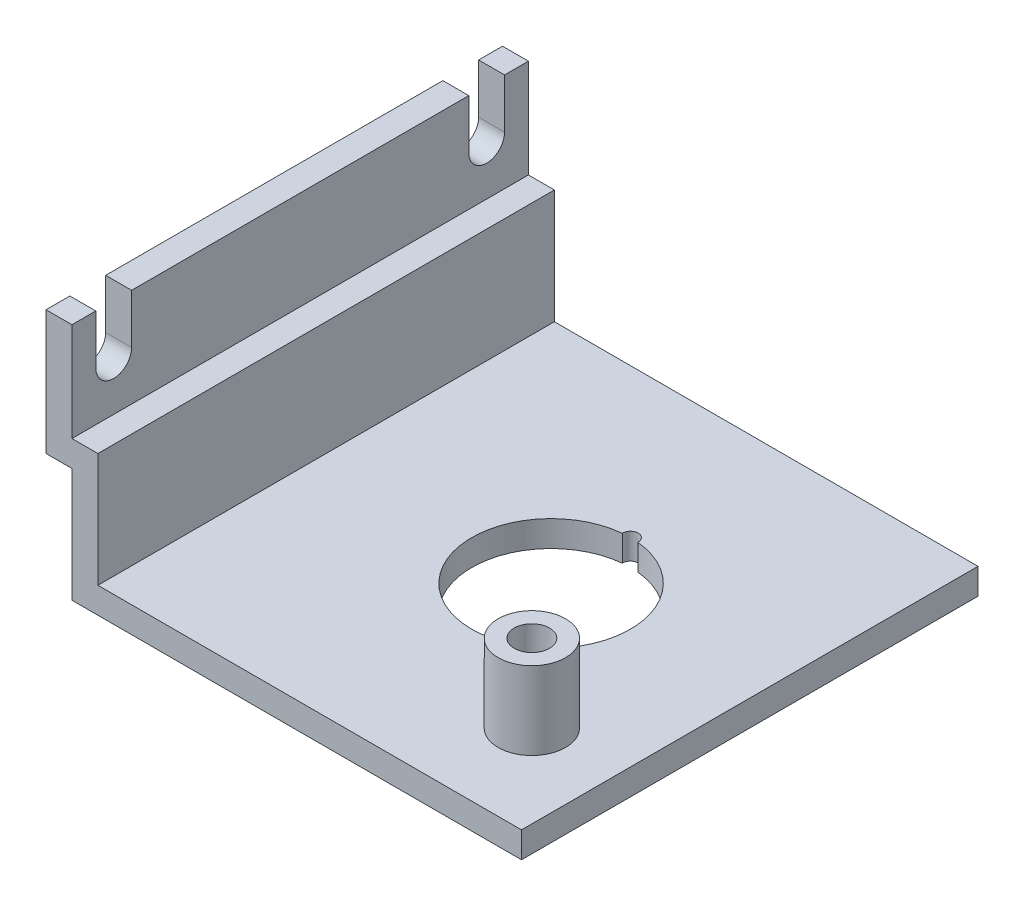
ISO-10303-21;
HEADER;
FILE_DESCRIPTION(('STEP AP214'),'2;1');
FILE_NAME('part.step','',(''),(''),'','','');
FILE_SCHEMA(('AUTOMOTIVE_DESIGN { 1 0 10303 214 1 1 1 1 }'));
ENDSEC;
DATA;
#1=APPLICATION_CONTEXT('core data for automotive mechanical design processes');
#2=APPLICATION_PROTOCOL_DEFINITION('international standard','automotive_design',2000,#1);
#3=PRODUCT_CONTEXT('',#1,'mechanical');
#4=PRODUCT('Part','Part','',(#3));
#5=PRODUCT_RELATED_PRODUCT_CATEGORY('part','',(#4));
#6=PRODUCT_DEFINITION_FORMATION('','',#4);
#7=PRODUCT_DEFINITION_CONTEXT('part definition',#1,'design');
#8=PRODUCT_DEFINITION('design','',#6,#7);
#9=PRODUCT_DEFINITION_SHAPE('','',#8);
#10=(LENGTH_UNIT() NAMED_UNIT(*) SI_UNIT(.MILLI.,.METRE.));
#11=(NAMED_UNIT(*) PLANE_ANGLE_UNIT() SI_UNIT($,.RADIAN.));
#12=(NAMED_UNIT(*) SI_UNIT($,.STERADIAN.) SOLID_ANGLE_UNIT());
#13=UNCERTAINTY_MEASURE_WITH_UNIT(LENGTH_MEASURE(1.E-05),#10,'distance_accuracy_value','');
#14=(GEOMETRIC_REPRESENTATION_CONTEXT(3) GLOBAL_UNCERTAINTY_ASSIGNED_CONTEXT((#13)) GLOBAL_UNIT_ASSIGNED_CONTEXT((#10,
#11,#12)) REPRESENTATION_CONTEXT('',''));
#15=CARTESIAN_POINT('',(0.,0.,0.));
#16=DIRECTION('',(0.,0.,1.));
#17=DIRECTION('',(1.,0.,0.));
#18=AXIS2_PLACEMENT_3D('',#15,#16,#17);
#19=CARTESIAN_POINT('',(-4.99999999999999,46.,88.));
#20=DIRECTION('',(0.,-1.,0.));
#21=DIRECTION('',(0.,0.,-1.));
#22=AXIS2_PLACEMENT_3D('',#19,#20,#21);
#23=PLANE('',#22);
#24=DIRECTION('',(0.,0.,-1.));
#25=VECTOR('',#24,1.);
#26=CARTESIAN_POINT('',(0.,46.,88.));
#27=LINE('',#26,#25);
#28=CARTESIAN_POINT('',(0.,46.,76.5));
#29=VERTEX_POINT('',#28);
#30=CARTESIAN_POINT('',(0.,46.,11.5));
#31=VERTEX_POINT('',#30);
#32=EDGE_CURVE('E319',#29,#31,#27,.T.);
#33=ORIENTED_EDGE('',*,*,#32,.T.);
#34=DIRECTION('',(-1.,0.,0.));
#35=VECTOR('',#34,1.);
#36=CARTESIAN_POINT('',(86.661,46.,11.5));
#37=LINE('',#36,#35);
#38=CARTESIAN_POINT('',(-4.99999999999999,46.,11.5));
#39=VERTEX_POINT('',#38);
#40=EDGE_CURVE('E223',#31,#39,#37,.T.);
#41=ORIENTED_EDGE('',*,*,#40,.T.);
#42=DIRECTION('',(0.,0.,-1.));
#43=VECTOR('',#42,1.);
#44=CARTESIAN_POINT('',(-4.99999999999999,46.,88.));
#45=LINE('',#44,#43);
#46=CARTESIAN_POINT('',(-4.99999999999999,46.,76.5));
#47=VERTEX_POINT('',#46);
#48=EDGE_CURVE('E314',#47,#39,#45,.T.);
#49=ORIENTED_EDGE('',*,*,#48,.F.);
#50=DIRECTION('',(-1.,0.,0.));
#51=VECTOR('',#50,1.);
#52=CARTESIAN_POINT('',(86.661,46.,76.5));
#53=LINE('',#52,#51);
#54=EDGE_CURVE('E248',#29,#47,#53,.T.);
#55=ORIENTED_EDGE('',*,*,#54,.F.);
#56=EDGE_LOOP('',(#33,#41,#49,#55));
#57=FACE_BOUND('',#56,.T.);
#58=ADVANCED_FACE('F39',(#57),#23,.F.);
#59=CARTESIAN_POINT('',(-4.99999999999999,46.,4.60000000000001));
#60=VERTEX_POINT('',#59);
#61=CARTESIAN_POINT('',(-4.99999999999999,46.,0.));
#62=VERTEX_POINT('',#61);
#63=EDGE_CURVE('E309',#60,#62,#45,.T.);
#64=ORIENTED_EDGE('',*,*,#63,.F.);
#65=DIRECTION('',(-1.,0.,0.));
#66=VECTOR('',#65,1.);
#67=CARTESIAN_POINT('',(86.661,46.,4.59999999999999));
#68=LINE('',#67,#66);
#69=CARTESIAN_POINT('',(0.,46.,4.59999999999999));
#70=VERTEX_POINT('',#69);
#71=EDGE_CURVE('E222',#70,#60,#68,.T.);
#72=ORIENTED_EDGE('',*,*,#71,.F.);
#73=CARTESIAN_POINT('',(0.,46.,0.));
#74=VERTEX_POINT('',#73);
#75=EDGE_CURVE('E313',#70,#74,#27,.T.);
#76=ORIENTED_EDGE('',*,*,#75,.T.);
#77=DIRECTION('',(-1.,0.,0.));
#78=VECTOR('',#77,1.);
#79=CARTESIAN_POINT('',(-4.99999999999999,46.,0.));
#80=LINE('',#79,#78);
#81=EDGE_CURVE('E293',#74,#62,#80,.T.);
#82=ORIENTED_EDGE('',*,*,#81,.T.);
#83=EDGE_LOOP('',(#64,#72,#76,#82));
#84=FACE_BOUND('',#83,.T.);
#85=ADVANCED_FACE('F378',(#84),#23,.F.);
#86=CARTESIAN_POINT('',(86.66,0.,88.));
#87=DIRECTION('',(0.,1.,0.));
#88=DIRECTION('',(-1.,0.,0.));
#89=AXIS2_PLACEMENT_3D('',#86,#87,#88);
#90=PLANE('',#89);
#91=CARTESIAN_POINT('',(48.36,0.,44.));
#92=DIRECTION('',(0.,-1.,0.));
#93=DIRECTION('',(1.,0.,0.));
#94=AXIS2_PLACEMENT_3D('',#91,#92,#93);
#95=CIRCLE('',#94,15.3);
#96=CARTESIAN_POINT('',(49.8581967246011,0.,28.7735294117647));
#97=VERTEX_POINT('',#96);
#98=CARTESIAN_POINT('',(46.8618032753989,0.,28.7735294117647));
#99=VERTEX_POINT('',#98);
#100=EDGE_CURVE('E196',#97,#99,#95,.T.);
#101=ORIENTED_EDGE('',*,*,#100,.F.);
#102=CARTESIAN_POINT('',(48.36,0.,28.7));
#103=DIRECTION('',(0.,-1.,0.));
#104=DIRECTION('',(1.,0.,0.));
#105=AXIS2_PLACEMENT_3D('',#102,#103,#104);
#106=CIRCLE('',#105,1.5);
#107=EDGE_CURVE('E54',#99,#97,#106,.T.);
#108=ORIENTED_EDGE('',*,*,#107,.F.);
#109=EDGE_LOOP('',(#101,#108));
#110=FACE_BOUND('',#109,.T.);
#111=DIRECTION('',(1.,0.,0.));
#112=VECTOR('',#111,1.);
#113=CARTESIAN_POINT('',(86.66,0.,0.));
#114=LINE('',#113,#112);
#115=CARTESIAN_POINT('',(0.,0.,0.));
#116=VERTEX_POINT('',#115);
#117=CARTESIAN_POINT('',(86.66,0.,0.));
#118=VERTEX_POINT('',#117);
#119=EDGE_CURVE('E233',#116,#118,#114,.T.);
#120=ORIENTED_EDGE('',*,*,#119,.T.);
#121=DIRECTION('',(0.,0.,-1.));
#122=VECTOR('',#121,1.);
#123=CARTESIAN_POINT('',(86.66,0.,88.));
#124=LINE('',#123,#122);
#125=CARTESIAN_POINT('',(86.66,0.,88.));
#126=VERTEX_POINT('',#125);
#127=EDGE_CURVE('E47',#126,#118,#124,.T.);
#128=ORIENTED_EDGE('',*,*,#127,.F.);
#129=DIRECTION('',(1.,0.,0.));
#130=VECTOR('',#129,1.);
#131=CARTESIAN_POINT('',(86.66,0.,88.));
#132=LINE('',#131,#130);
#133=CARTESIAN_POINT('',(0.,0.,88.));
#134=VERTEX_POINT('',#133);
#135=EDGE_CURVE('E257',#134,#126,#132,.T.);
#136=ORIENTED_EDGE('',*,*,#135,.F.);
#137=DIRECTION('',(0.,0.,-1.));
#138=VECTOR('',#137,1.);
#139=CARTESIAN_POINT('',(0.,0.,88.));
#140=LINE('',#139,#138);
#141=EDGE_CURVE('E279',#134,#116,#140,.T.);
#142=ORIENTED_EDGE('',*,*,#141,.T.);
#143=EDGE_LOOP('',(#120,#128,#136,#142));
#144=FACE_BOUND('',#143,.T.);
#145=ADVANCED_FACE('F41',(#110,#144),#90,.F.);
#146=CARTESIAN_POINT('',(86.66,4.99999999999999,88.));
#147=DIRECTION('',(-1.,0.,0.));
#148=DIRECTION('',(0.,0.,1.));
#149=AXIS2_PLACEMENT_3D('',#146,#147,#148);
#150=PLANE('',#149);
#151=DIRECTION('',(0.,1.,0.));
#152=VECTOR('',#151,1.);
#153=CARTESIAN_POINT('',(86.66,4.99999999999999,0.));
#154=LINE('',#153,#152);
#155=CARTESIAN_POINT('',(86.66,4.99999999999999,0.));
#156=VERTEX_POINT('',#155);
#157=EDGE_CURVE('E282',#118,#156,#154,.T.);
#158=ORIENTED_EDGE('',*,*,#157,.T.);
#159=DIRECTION('',(0.,0.,-1.));
#160=VECTOR('',#159,1.);
#161=CARTESIAN_POINT('',(86.66,4.99999999999999,88.));
#162=LINE('',#161,#160);
#163=CARTESIAN_POINT('',(86.66,4.99999999999999,88.));
#164=VERTEX_POINT('',#163);
#165=EDGE_CURVE('E328',#164,#156,#162,.T.);
#166=ORIENTED_EDGE('',*,*,#165,.F.);
#167=DIRECTION('',(0.,1.,0.));
#168=VECTOR('',#167,1.);
#169=CARTESIAN_POINT('',(86.66,4.99999999999999,88.));
#170=LINE('',#169,#168);
#171=EDGE_CURVE('E260',#126,#164,#170,.T.);
#172=ORIENTED_EDGE('',*,*,#171,.F.);
#173=ORIENTED_EDGE('',*,*,#127,.T.);
#174=EDGE_LOOP('',(#158,#166,#172,#173));
#175=FACE_BOUND('',#174,.T.);
#176=ADVANCED_FACE('F333',(#175),#150,.F.);
#177=CARTESIAN_POINT('',(5.,4.99999999999999,88.));
#178=DIRECTION('',(0.,-1.,0.));
#179=DIRECTION('',(1.,0.,0.));
#180=AXIS2_PLACEMENT_3D('',#177,#178,#179);
#181=PLANE('',#180);
#182=CARTESIAN_POINT('',(70.66,4.99999999999999,70.));
#183=DIRECTION('',(0.,-1.,0.));
#184=DIRECTION('',(1.,0.,0.));
#185=AXIS2_PLACEMENT_3D('',#182,#183,#184);
#186=CIRCLE('',#185,6.5);
#187=CARTESIAN_POINT('',(77.16,4.99999999999999,70.));
#188=VERTEX_POINT('',#187);
#189=EDGE_CURVE('E11',#188,#188,#186,.F.);
#190=ORIENTED_EDGE('',*,*,#189,.F.);
#191=EDGE_LOOP('',(#190));
#192=FACE_BOUND('',#191,.T.);
#193=CARTESIAN_POINT('',(48.36,4.99999999999999,44.));
#194=DIRECTION('',(0.,-1.,0.));
#195=DIRECTION('',(1.,0.,0.));
#196=AXIS2_PLACEMENT_3D('',#193,#194,#195);
#197=CIRCLE('',#196,15.3);
#198=CARTESIAN_POINT('',(46.8618032753989,4.99999999999999,28.7735294117647));
#199=VERTEX_POINT('',#198);
#200=CARTESIAN_POINT('',(49.8581967246011,4.99999999999999,28.7735294117647));
#201=VERTEX_POINT('',#200);
#202=EDGE_CURVE('E202',#199,#201,#197,.F.);
#203=ORIENTED_EDGE('',*,*,#202,.F.);
#204=CARTESIAN_POINT('',(48.36,4.99999999999999,28.7));
#205=DIRECTION('',(0.,-1.,0.));
#206=DIRECTION('',(1.,0.,0.));
#207=AXIS2_PLACEMENT_3D('',#204,#205,#206);
#208=CIRCLE('',#207,1.5);
#209=EDGE_CURVE('E59',#201,#199,#208,.F.);
#210=ORIENTED_EDGE('',*,*,#209,.F.);
#211=EDGE_LOOP('',(#203,#210));
#212=FACE_BOUND('',#211,.T.);
#213=DIRECTION('',(-1.,0.,0.));
#214=VECTOR('',#213,1.);
#215=CARTESIAN_POINT('',(5.,4.99999999999999,0.));
#216=LINE('',#215,#214);
#217=CARTESIAN_POINT('',(5.,4.99999999999999,0.));
#218=VERTEX_POINT('',#217);
#219=EDGE_CURVE('E284',#156,#218,#216,.T.);
#220=ORIENTED_EDGE('',*,*,#219,.T.);
#221=DIRECTION('',(0.,0.,-1.));
#222=VECTOR('',#221,1.);
#223=CARTESIAN_POINT('',(5.,4.99999999999999,88.));
#224=LINE('',#223,#222);
#225=CARTESIAN_POINT('',(5.,4.99999999999999,88.));
#226=VERTEX_POINT('',#225);
#227=EDGE_CURVE('E325',#226,#218,#224,.T.);
#228=ORIENTED_EDGE('',*,*,#227,.F.);
#229=DIRECTION('',(-1.,0.,0.));
#230=VECTOR('',#229,1.);
#231=CARTESIAN_POINT('',(5.,4.99999999999999,88.));
#232=LINE('',#231,#230);
#233=EDGE_CURVE('E263',#164,#226,#232,.T.);
#234=ORIENTED_EDGE('',*,*,#233,.F.);
#235=ORIENTED_EDGE('',*,*,#165,.T.);
#236=EDGE_LOOP('',(#220,#228,#234,#235));
#237=FACE_BOUND('',#236,.T.);
#238=ADVANCED_FACE('F348',(#192,#212,#237),#181,.F.);
#239=CARTESIAN_POINT('',(4.99999999999999,27.,88.));
#240=DIRECTION('',(-1.,0.,0.));
#241=DIRECTION('',(0.,-1.,0.));
#242=AXIS2_PLACEMENT_3D('',#239,#240,#241);
#243=PLANE('',#242);
#244=DIRECTION('',(0.,1.,0.));
#245=VECTOR('',#244,1.);
#246=CARTESIAN_POINT('',(4.99999999999999,27.,0.));
#247=LINE('',#246,#245);
#248=CARTESIAN_POINT('',(4.99999999999999,27.,0.));
#249=VERTEX_POINT('',#248);
#250=EDGE_CURVE('E286',#218,#249,#247,.T.);
#251=ORIENTED_EDGE('',*,*,#250,.T.);
#252=DIRECTION('',(0.,0.,-1.));
#253=VECTOR('',#252,1.);
#254=CARTESIAN_POINT('',(4.99999999999999,27.,88.));
#255=LINE('',#254,#253);
#256=CARTESIAN_POINT('',(4.99999999999999,27.,88.));
#257=VERTEX_POINT('',#256);
#258=EDGE_CURVE('E322',#257,#249,#255,.T.);
#259=ORIENTED_EDGE('',*,*,#258,.F.);
#260=DIRECTION('',(0.,1.,0.));
#261=VECTOR('',#260,1.);
#262=CARTESIAN_POINT('',(4.99999999999999,27.,88.));
#263=LINE('',#262,#261);
#264=EDGE_CURVE('E265',#226,#257,#263,.T.);
#265=ORIENTED_EDGE('',*,*,#264,.F.);
#266=ORIENTED_EDGE('',*,*,#227,.T.);
#267=EDGE_LOOP('',(#251,#259,#265,#266));
#268=FACE_BOUND('',#267,.T.);
#269=ADVANCED_FACE('F352',(#268),#243,.F.);
#270=CARTESIAN_POINT('',(0.,27.,88.));
#271=DIRECTION('',(0.,-1.,0.));
#272=DIRECTION('',(0.,0.,-1.));
#273=AXIS2_PLACEMENT_3D('',#270,#271,#272);
#274=PLANE('',#273);
#275=DIRECTION('',(-1.,0.,0.));
#276=VECTOR('',#275,1.);
#277=CARTESIAN_POINT('',(0.,27.,0.));
#278=LINE('',#277,#276);
#279=CARTESIAN_POINT('',(0.,27.,0.));
#280=VERTEX_POINT('',#279);
#281=EDGE_CURVE('E288',#249,#280,#278,.T.);
#282=ORIENTED_EDGE('',*,*,#281,.T.);
#283=DIRECTION('',(0.,0.,-1.));
#284=VECTOR('',#283,1.);
#285=CARTESIAN_POINT('',(0.,27.,88.));
#286=LINE('',#285,#284);
#287=CARTESIAN_POINT('',(0.,27.,88.));
#288=VERTEX_POINT('',#287);
#289=EDGE_CURVE('E318',#288,#280,#286,.T.);
#290=ORIENTED_EDGE('',*,*,#289,.F.);
#291=DIRECTION('',(-1.,0.,0.));
#292=VECTOR('',#291,1.);
#293=CARTESIAN_POINT('',(0.,27.,88.));
#294=LINE('',#293,#292);
#295=EDGE_CURVE('E267',#257,#288,#294,.T.);
#296=ORIENTED_EDGE('',*,*,#295,.F.);
#297=ORIENTED_EDGE('',*,*,#258,.T.);
#298=EDGE_LOOP('',(#282,#290,#296,#297));
#299=FACE_BOUND('',#298,.T.);
#300=ADVANCED_FACE('F386',(#299),#274,.F.);
#301=CARTESIAN_POINT('',(0.,46.,88.));
#302=DIRECTION('',(-1.,0.,0.));
#303=DIRECTION('',(0.,-1.,0.));
#304=AXIS2_PLACEMENT_3D('',#301,#302,#303);
#305=PLANE('',#304);
#306=CARTESIAN_POINT('',(0.,36.45,8.05));
#307=DIRECTION('',(-1.,0.,0.));
#308=DIRECTION('',(0.,-1.,0.));
#309=AXIS2_PLACEMENT_3D('',#306,#307,#308);
#310=CIRCLE('',#309,3.45);
#311=CARTESIAN_POINT('',(0.,36.45,11.5));
#312=VERTEX_POINT('',#311);
#313=CARTESIAN_POINT('',(0.,36.45,4.6));
#314=VERTEX_POINT('',#313);
#315=EDGE_CURVE('E207',#312,#314,#310,.F.);
#316=ORIENTED_EDGE('',*,*,#315,.F.);
#317=DIRECTION('',(0.,-1.,0.));
#318=VECTOR('',#317,1.);
#319=CARTESIAN_POINT('',(0.,36.45,11.5));
#320=LINE('',#319,#318);
#321=EDGE_CURVE('E210',#31,#312,#320,.T.);
#322=ORIENTED_EDGE('',*,*,#321,.F.);
#323=ORIENTED_EDGE('',*,*,#32,.F.);
#324=DIRECTION('',(0.,1.,0.));
#325=VECTOR('',#324,1.);
#326=CARTESIAN_POINT('',(0.,36.45,76.5));
#327=LINE('',#326,#325);
#328=CARTESIAN_POINT('',(0.,36.45,76.5));
#329=VERTEX_POINT('',#328);
#330=EDGE_CURVE('E236',#329,#29,#327,.T.);
#331=ORIENTED_EDGE('',*,*,#330,.F.);
#332=CARTESIAN_POINT('',(0.,36.45,79.95));
#333=DIRECTION('',(-1.,0.,0.));
#334=DIRECTION('',(0.,-1.,0.));
#335=AXIS2_PLACEMENT_3D('',#332,#333,#334);
#336=CIRCLE('',#335,3.45000000000001);
#337=CARTESIAN_POINT('',(0.,36.45,83.4));
#338=VERTEX_POINT('',#337);
#339=EDGE_CURVE('E206',#338,#329,#336,.F.);
#340=ORIENTED_EDGE('',*,*,#339,.F.);
#341=DIRECTION('',(0.,-1.,0.));
#342=VECTOR('',#341,1.);
#343=CARTESIAN_POINT('',(0.,46.,83.4));
#344=LINE('',#343,#342);
#345=CARTESIAN_POINT('',(0.,46.,83.4));
#346=VERTEX_POINT('',#345);
#347=EDGE_CURVE('E211',#346,#338,#344,.T.);
#348=ORIENTED_EDGE('',*,*,#347,.F.);
#349=CARTESIAN_POINT('',(0.,46.,88.));
#350=VERTEX_POINT('',#349);
#351=EDGE_CURVE('E315',#350,#346,#27,.T.);
#352=ORIENTED_EDGE('',*,*,#351,.F.);
#353=DIRECTION('',(0.,1.,0.));
#354=VECTOR('',#353,1.);
#355=CARTESIAN_POINT('',(0.,46.,88.));
#356=LINE('',#355,#354);
#357=EDGE_CURVE('E269',#288,#350,#356,.T.);
#358=ORIENTED_EDGE('',*,*,#357,.F.);
#359=ORIENTED_EDGE('',*,*,#289,.T.);
#360=DIRECTION('',(0.,1.,0.));
#361=VECTOR('',#360,1.);
#362=CARTESIAN_POINT('',(0.,46.,0.));
#363=LINE('',#362,#361);
#364=EDGE_CURVE('E290',#280,#74,#363,.T.);
#365=ORIENTED_EDGE('',*,*,#364,.T.);
#366=ORIENTED_EDGE('',*,*,#75,.F.);
#367=DIRECTION('',(0.,1.,0.));
#368=VECTOR('',#367,1.);
#369=CARTESIAN_POINT('',(0.,46.,4.59999999999999));
#370=LINE('',#369,#368);
#371=EDGE_CURVE('E226',#314,#70,#370,.T.);
#372=ORIENTED_EDGE('',*,*,#371,.F.);
#373=EDGE_LOOP('',(#316,#322,#323,#331,#340,#348,#352,#358,#359,#365,#366,#372));
#374=FACE_BOUND('',#373,.T.);
#375=ADVANCED_FACE('F383',(#374),#305,.F.);
#376=ORIENTED_EDGE('',*,*,#351,.T.);
#377=DIRECTION('',(-1.,0.,0.));
#378=VECTOR('',#377,1.);
#379=CARTESIAN_POINT('',(86.661,46.,83.4));
#380=LINE('',#379,#378);
#381=CARTESIAN_POINT('',(-4.99999999999999,46.,83.4));
#382=VERTEX_POINT('',#381);
#383=EDGE_CURVE('E250',#346,#382,#380,.T.);
#384=ORIENTED_EDGE('',*,*,#383,.T.);
#385=CARTESIAN_POINT('',(-4.99999999999999,46.,88.));
#386=VERTEX_POINT('',#385);
#387=EDGE_CURVE('E310',#386,#382,#45,.T.);
#388=ORIENTED_EDGE('',*,*,#387,.F.);
#389=DIRECTION('',(-1.,0.,0.));
#390=VECTOR('',#389,1.);
#391=CARTESIAN_POINT('',(-4.99999999999999,46.,88.));
#392=LINE('',#391,#390);
#393=EDGE_CURVE('E271',#350,#386,#392,.T.);
#394=ORIENTED_EDGE('',*,*,#393,.F.);
#395=EDGE_LOOP('',(#376,#384,#388,#394));
#396=FACE_BOUND('',#395,.T.);
#397=ADVANCED_FACE('F392',(#396),#23,.F.);
#398=CARTESIAN_POINT('',(-4.99999999999999,22.,88.));
#399=DIRECTION('',(1.,0.,0.));
#400=DIRECTION('',(0.,0.,-1.));
#401=AXIS2_PLACEMENT_3D('',#398,#399,#400);
#402=PLANE('',#401);
#403=ORIENTED_EDGE('',*,*,#48,.T.);
#404=DIRECTION('',(0.,1.,0.));
#405=VECTOR('',#404,1.);
#406=CARTESIAN_POINT('',(-4.99999999999999,36.45,11.5));
#407=LINE('',#406,#405);
#408=CARTESIAN_POINT('',(-4.99999999999999,36.45,11.5));
#409=VERTEX_POINT('',#408);
#410=EDGE_CURVE('E220',#409,#39,#407,.T.);
#411=ORIENTED_EDGE('',*,*,#410,.F.);
#412=CARTESIAN_POINT('',(-4.99999999999999,36.45,8.05));
#413=DIRECTION('',(-1.,0.,0.));
#414=DIRECTION('',(0.,0.,1.));
#415=AXIS2_PLACEMENT_3D('',#412,#413,#414);
#416=CIRCLE('',#415,3.45);
#417=CARTESIAN_POINT('',(-4.99999999999999,36.45,4.6));
#418=VERTEX_POINT('',#417);
#419=EDGE_CURVE('E217',#418,#409,#416,.T.);
#420=ORIENTED_EDGE('',*,*,#419,.F.);
#421=DIRECTION('',(0.,-1.,0.));
#422=VECTOR('',#421,1.);
#423=CARTESIAN_POINT('',(-4.99999999999999,46.,4.59999999999999));
#424=LINE('',#423,#422);
#425=EDGE_CURVE('E214',#60,#418,#424,.T.);
#426=ORIENTED_EDGE('',*,*,#425,.F.);
#427=ORIENTED_EDGE('',*,*,#63,.T.);
#428=DIRECTION('',(0.,-1.,0.));
#429=VECTOR('',#428,1.);
#430=CARTESIAN_POINT('',(-4.99999999999999,22.,0.));
#431=LINE('',#430,#429);
#432=CARTESIAN_POINT('',(-4.99999999999999,22.,0.));
#433=VERTEX_POINT('',#432);
#434=EDGE_CURVE('E296',#62,#433,#431,.T.);
#435=ORIENTED_EDGE('',*,*,#434,.T.);
#436=DIRECTION('',(0.,0.,-1.));
#437=VECTOR('',#436,1.);
#438=CARTESIAN_POINT('',(-4.99999999999999,22.,88.));
#439=LINE('',#438,#437);
#440=CARTESIAN_POINT('',(-4.99999999999999,22.,88.));
#441=VERTEX_POINT('',#440);
#442=EDGE_CURVE('E306',#441,#433,#439,.T.);
#443=ORIENTED_EDGE('',*,*,#442,.F.);
#444=DIRECTION('',(0.,-1.,0.));
#445=VECTOR('',#444,1.);
#446=CARTESIAN_POINT('',(-4.99999999999999,22.,88.));
#447=LINE('',#446,#445);
#448=EDGE_CURVE('E273',#386,#441,#447,.T.);
#449=ORIENTED_EDGE('',*,*,#448,.F.);
#450=ORIENTED_EDGE('',*,*,#387,.T.);
#451=DIRECTION('',(0.,1.,0.));
#452=VECTOR('',#451,1.);
#453=CARTESIAN_POINT('',(-4.99999999999999,46.,83.4));
#454=LINE('',#453,#452);
#455=CARTESIAN_POINT('',(-4.99999999999999,36.45,83.4));
#456=VERTEX_POINT('',#455);
#457=EDGE_CURVE('E240',#456,#382,#454,.T.);
#458=ORIENTED_EDGE('',*,*,#457,.F.);
#459=CARTESIAN_POINT('',(-4.99999999999999,36.45,79.95));
#460=DIRECTION('',(-1.,0.,0.));
#461=DIRECTION('',(0.,0.,-1.));
#462=AXIS2_PLACEMENT_3D('',#459,#460,#461);
#463=CIRCLE('',#462,3.45000000000001);
#464=CARTESIAN_POINT('',(-4.99999999999999,36.45,76.5));
#465=VERTEX_POINT('',#464);
#466=EDGE_CURVE('E238',#465,#456,#463,.T.);
#467=ORIENTED_EDGE('',*,*,#466,.F.);
#468=DIRECTION('',(0.,-1.,0.));
#469=VECTOR('',#468,1.);
#470=CARTESIAN_POINT('',(-4.99999999999999,36.45,76.5));
#471=LINE('',#470,#469);
#472=EDGE_CURVE('E242',#47,#465,#471,.T.);
#473=ORIENTED_EDGE('',*,*,#472,.F.);
#474=EDGE_LOOP('',(#403,#411,#420,#426,#427,#435,#443,#449,#450,#458,#467,#473));
#475=FACE_BOUND('',#474,.T.);
#476=ADVANCED_FACE('F371',(#475),#402,.F.);
#477=CARTESIAN_POINT('',(0.,22.,88.));
#478=DIRECTION('',(0.,1.,0.));
#479=DIRECTION('',(0.,0.,1.));
#480=AXIS2_PLACEMENT_3D('',#477,#478,#479);
#481=PLANE('',#480);
#482=DIRECTION('',(1.,0.,0.));
#483=VECTOR('',#482,1.);
#484=CARTESIAN_POINT('',(0.,22.,0.));
#485=LINE('',#484,#483);
#486=CARTESIAN_POINT('',(0.,22.,0.));
#487=VERTEX_POINT('',#486);
#488=EDGE_CURVE('E298',#433,#487,#485,.T.);
#489=ORIENTED_EDGE('',*,*,#488,.T.);
#490=DIRECTION('',(0.,0.,-1.));
#491=VECTOR('',#490,1.);
#492=CARTESIAN_POINT('',(0.,22.,88.));
#493=LINE('',#492,#491);
#494=CARTESIAN_POINT('',(0.,22.,88.));
#495=VERTEX_POINT('',#494);
#496=EDGE_CURVE('E303',#495,#487,#493,.T.);
#497=ORIENTED_EDGE('',*,*,#496,.F.);
#498=DIRECTION('',(1.,0.,0.));
#499=VECTOR('',#498,1.);
#500=CARTESIAN_POINT('',(0.,22.,88.));
#501=LINE('',#500,#499);
#502=EDGE_CURVE('E275',#441,#495,#501,.T.);
#503=ORIENTED_EDGE('',*,*,#502,.F.);
#504=ORIENTED_EDGE('',*,*,#442,.T.);
#505=EDGE_LOOP('',(#489,#497,#503,#504));
#506=FACE_BOUND('',#505,.T.);
#507=ADVANCED_FACE('F364',(#506),#481,.F.);
#508=CARTESIAN_POINT('',(0.,0.,88.));
#509=DIRECTION('',(1.,0.,0.));
#510=DIRECTION('',(0.,0.,-1.));
#511=AXIS2_PLACEMENT_3D('',#508,#509,#510);
#512=PLANE('',#511);
#513=DIRECTION('',(0.,-1.,0.));
#514=VECTOR('',#513,1.);
#515=CARTESIAN_POINT('',(0.,0.,0.));
#516=LINE('',#515,#514);
#517=EDGE_CURVE('E261',#487,#116,#516,.T.);
#518=ORIENTED_EDGE('',*,*,#517,.T.);
#519=ORIENTED_EDGE('',*,*,#141,.F.);
#520=DIRECTION('',(0.,-1.,0.));
#521=VECTOR('',#520,1.);
#522=CARTESIAN_POINT('',(0.,0.,88.));
#523=LINE('',#522,#521);
#524=EDGE_CURVE('E277',#495,#134,#523,.T.);
#525=ORIENTED_EDGE('',*,*,#524,.F.);
#526=ORIENTED_EDGE('',*,*,#496,.T.);
#527=EDGE_LOOP('',(#518,#519,#525,#526));
#528=FACE_BOUND('',#527,.T.);
#529=ADVANCED_FACE('F362',(#528),#512,.F.);
#530=CARTESIAN_POINT('',(0.,0.,88.));
#531=DIRECTION('',(0.,0.,-1.));
#532=DIRECTION('',(-1.,0.,0.));
#533=AXIS2_PLACEMENT_3D('',#530,#531,#532);
#534=PLANE('',#533);
#535=ORIENTED_EDGE('',*,*,#135,.T.);
#536=ORIENTED_EDGE('',*,*,#171,.T.);
#537=ORIENTED_EDGE('',*,*,#233,.T.);
#538=ORIENTED_EDGE('',*,*,#264,.T.);
#539=ORIENTED_EDGE('',*,*,#295,.T.);
#540=ORIENTED_EDGE('',*,*,#357,.T.);
#541=ORIENTED_EDGE('',*,*,#393,.T.);
#542=ORIENTED_EDGE('',*,*,#448,.T.);
#543=ORIENTED_EDGE('',*,*,#502,.T.);
#544=ORIENTED_EDGE('',*,*,#524,.T.);
#545=EDGE_LOOP('',(#535,#536,#537,#538,#539,#540,#541,#542,#543,#544));
#546=FACE_BOUND('',#545,.T.);
#547=ADVANCED_FACE('F356',(#546),#534,.F.);
#548=CARTESIAN_POINT('',(0.,0.,0.));
#549=DIRECTION('',(0.,0.,-1.));
#550=DIRECTION('',(-1.,0.,0.));
#551=AXIS2_PLACEMENT_3D('',#548,#549,#550);
#552=PLANE('',#551);
#553=ORIENTED_EDGE('',*,*,#119,.F.);
#554=ORIENTED_EDGE('',*,*,#517,.F.);
#555=ORIENTED_EDGE('',*,*,#488,.F.);
#556=ORIENTED_EDGE('',*,*,#434,.F.);
#557=ORIENTED_EDGE('',*,*,#81,.F.);
#558=ORIENTED_EDGE('',*,*,#364,.F.);
#559=ORIENTED_EDGE('',*,*,#281,.F.);
#560=ORIENTED_EDGE('',*,*,#250,.F.);
#561=ORIENTED_EDGE('',*,*,#219,.F.);
#562=ORIENTED_EDGE('',*,*,#157,.F.);
#563=EDGE_LOOP('',(#553,#554,#555,#556,#557,#558,#559,#560,#561,#562));
#564=FACE_BOUND('',#563,.T.);
#565=ADVANCED_FACE('F341',(#564),#552,.T.);
#566=CARTESIAN_POINT('',(86.661,36.45,79.95));
#567=DIRECTION('',(-1.,0.,0.));
#568=DIRECTION('',(0.,0.,1.));
#569=AXIS2_PLACEMENT_3D('',#566,#567,#568);
#570=CYLINDRICAL_SURFACE('',#569,3.45000000000001);
#571=ORIENTED_EDGE('',*,*,#339,.T.);
#572=DIRECTION('',(-1.,0.,0.));
#573=VECTOR('',#572,1.);
#574=CARTESIAN_POINT('',(86.661,36.45,76.5));
#575=LINE('',#574,#573);
#576=EDGE_CURVE('E246',#329,#465,#575,.T.);
#577=ORIENTED_EDGE('',*,*,#576,.T.);
#578=ORIENTED_EDGE('',*,*,#466,.T.);
#579=DIRECTION('',(-1.,0.,0.));
#580=VECTOR('',#579,1.);
#581=CARTESIAN_POINT('',(86.661,36.45,83.4));
#582=LINE('',#581,#580);
#583=EDGE_CURVE('E245',#338,#456,#582,.T.);
#584=ORIENTED_EDGE('',*,*,#583,.F.);
#585=EDGE_LOOP('',(#571,#577,#578,#584));
#586=FACE_BOUND('',#585,.T.);
#587=ADVANCED_FACE('F400',(#586),#570,.F.);
#588=CARTESIAN_POINT('',(86.661,36.45,76.5));
#589=DIRECTION('',(0.,0.,-1.));
#590=DIRECTION('',(-1.,0.,0.));
#591=AXIS2_PLACEMENT_3D('',#588,#589,#590);
#592=PLANE('',#591);
#593=ORIENTED_EDGE('',*,*,#330,.T.);
#594=ORIENTED_EDGE('',*,*,#54,.T.);
#595=ORIENTED_EDGE('',*,*,#472,.T.);
#596=ORIENTED_EDGE('',*,*,#576,.F.);
#597=EDGE_LOOP('',(#593,#594,#595,#596));
#598=FACE_BOUND('',#597,.T.);
#599=ADVANCED_FACE('F403',(#598),#592,.F.);
#600=CARTESIAN_POINT('',(86.661,46.,83.4));
#601=DIRECTION('',(0.,0.,1.));
#602=DIRECTION('',(1.,0.,0.));
#603=AXIS2_PLACEMENT_3D('',#600,#601,#602);
#604=PLANE('',#603);
#605=ORIENTED_EDGE('',*,*,#347,.T.);
#606=ORIENTED_EDGE('',*,*,#583,.T.);
#607=ORIENTED_EDGE('',*,*,#457,.T.);
#608=ORIENTED_EDGE('',*,*,#383,.F.);
#609=EDGE_LOOP('',(#605,#606,#607,#608));
#610=FACE_BOUND('',#609,.T.);
#611=ADVANCED_FACE('F397',(#610),#604,.F.);
#612=CARTESIAN_POINT('',(86.661,36.45,11.5));
#613=DIRECTION('',(0.,0.,1.));
#614=DIRECTION('',(1.,0.,0.));
#615=AXIS2_PLACEMENT_3D('',#612,#613,#614);
#616=PLANE('',#615);
#617=ORIENTED_EDGE('',*,*,#321,.T.);
#618=DIRECTION('',(-1.,0.,0.));
#619=VECTOR('',#618,1.);
#620=CARTESIAN_POINT('',(86.661,36.45,11.5));
#621=LINE('',#620,#619);
#622=EDGE_CURVE('E227',#312,#409,#621,.T.);
#623=ORIENTED_EDGE('',*,*,#622,.T.);
#624=ORIENTED_EDGE('',*,*,#410,.T.);
#625=ORIENTED_EDGE('',*,*,#40,.F.);
#626=EDGE_LOOP('',(#617,#623,#624,#625));
#627=FACE_BOUND('',#626,.T.);
#628=ADVANCED_FACE('F412',(#627),#616,.F.);
#629=CARTESIAN_POINT('',(86.661,36.45,8.05));
#630=DIRECTION('',(-1.,0.,0.));
#631=DIRECTION('',(0.,0.,1.));
#632=AXIS2_PLACEMENT_3D('',#629,#630,#631);
#633=CYLINDRICAL_SURFACE('',#632,3.45);
#634=ORIENTED_EDGE('',*,*,#315,.T.);
#635=DIRECTION('',(-1.,0.,0.));
#636=VECTOR('',#635,1.);
#637=CARTESIAN_POINT('',(86.661,36.45,4.6));
#638=LINE('',#637,#636);
#639=EDGE_CURVE('E229',#314,#418,#638,.T.);
#640=ORIENTED_EDGE('',*,*,#639,.T.);
#641=ORIENTED_EDGE('',*,*,#419,.T.);
#642=ORIENTED_EDGE('',*,*,#622,.F.);
#643=EDGE_LOOP('',(#634,#640,#641,#642));
#644=FACE_BOUND('',#643,.T.);
#645=ADVANCED_FACE('F414',(#644),#633,.F.);
#646=CARTESIAN_POINT('',(86.661,46.,4.59999999999999));
#647=DIRECTION('',(0.,0.,-1.));
#648=DIRECTION('',(0.,1.,0.));
#649=AXIS2_PLACEMENT_3D('',#646,#647,#648);
#650=PLANE('',#649);
#651=ORIENTED_EDGE('',*,*,#371,.T.);
#652=ORIENTED_EDGE('',*,*,#71,.T.);
#653=ORIENTED_EDGE('',*,*,#425,.T.);
#654=ORIENTED_EDGE('',*,*,#639,.F.);
#655=EDGE_LOOP('',(#651,#652,#653,#654));
#656=FACE_BOUND('',#655,.T.);
#657=ADVANCED_FACE('F416',(#656),#650,.F.);
#658=CARTESIAN_POINT('',(48.36,46.001,28.7));
#659=DIRECTION('',(0.,-1.,0.));
#660=DIRECTION('',(1.,0.,0.));
#661=AXIS2_PLACEMENT_3D('',#658,#659,#660);
#662=CYLINDRICAL_SURFACE('',#661,1.5);
#663=ORIENTED_EDGE('',*,*,#209,.T.);
#664=DIRECTION('',(0.,-1.,0.));
#665=VECTOR('',#664,1.);
#666=CARTESIAN_POINT('',(46.8618032753989,46.001,28.7735294117647));
#667=LINE('',#666,#665);
#668=EDGE_CURVE('E200',#199,#99,#667,.T.);
#669=ORIENTED_EDGE('',*,*,#668,.T.);
#670=ORIENTED_EDGE('',*,*,#107,.T.);
#671=DIRECTION('',(0.,-1.,0.));
#672=VECTOR('',#671,1.);
#673=CARTESIAN_POINT('',(49.8581967246011,46.001,28.7735294117647));
#674=LINE('',#673,#672);
#675=EDGE_CURVE('E199',#201,#97,#674,.T.);
#676=ORIENTED_EDGE('',*,*,#675,.F.);
#677=EDGE_LOOP('',(#663,#669,#670,#676));
#678=FACE_BOUND('',#677,.T.);
#679=ADVANCED_FACE('F418',(#678),#662,.F.);
#680=CARTESIAN_POINT('',(48.36,46.001,44.));
#681=DIRECTION('',(0.,-1.,0.));
#682=DIRECTION('',(1.,0.,0.));
#683=AXIS2_PLACEMENT_3D('',#680,#681,#682);
#684=CYLINDRICAL_SURFACE('',#683,15.3);
#685=ORIENTED_EDGE('',*,*,#202,.T.);
#686=ORIENTED_EDGE('',*,*,#675,.T.);
#687=ORIENTED_EDGE('',*,*,#100,.T.);
#688=ORIENTED_EDGE('',*,*,#668,.F.);
#689=EDGE_LOOP('',(#685,#686,#687,#688));
#690=FACE_BOUND('',#689,.T.);
#691=ADVANCED_FACE('F424',(#690),#684,.F.);
#692=CARTESIAN_POINT('',(70.66,20.,70.));
#693=DIRECTION('',(0.,-1.,0.));
#694=DIRECTION('',(1.,0.,0.));
#695=AXIS2_PLACEMENT_3D('',#692,#693,#694);
#696=CYLINDRICAL_SURFACE('',#695,6.5);
#697=CARTESIAN_POINT('',(70.66,20.,70.));
#698=DIRECTION('',(0.,1.,0.));
#699=DIRECTION('',(-1.,0.,0.));
#700=AXIS2_PLACEMENT_3D('',#697,#698,#699);
#701=CIRCLE('',#700,6.5);
#702=CARTESIAN_POINT('',(64.16,20.,70.));
#703=VERTEX_POINT('',#702);
#704=EDGE_CURVE('E186',#703,#703,#701,.T.);
#705=ORIENTED_EDGE('',*,*,#704,.F.);
#706=EDGE_LOOP('',(#705));
#707=FACE_BOUND('',#706,.T.);
#708=ORIENTED_EDGE('',*,*,#189,.T.);
#709=EDGE_LOOP('',(#708));
#710=FACE_BOUND('',#709,.T.);
#711=ADVANCED_FACE('F461',(#707,#710),#696,.T.);
#712=CARTESIAN_POINT('',(70.66,20.,70.));
#713=DIRECTION('',(0.,1.,0.));
#714=DIRECTION('',(-1.,0.,0.));
#715=AXIS2_PLACEMENT_3D('',#712,#713,#714);
#716=PLANE('',#715);
#717=CARTESIAN_POINT('',(70.66,20.,70.));
#718=DIRECTION('',(0.,1.,0.));
#719=DIRECTION('',(0.,0.,1.));
#720=AXIS2_PLACEMENT_3D('',#717,#718,#719);
#721=CIRCLE('',#720,3.4);
#722=CARTESIAN_POINT('',(70.66,20.,73.4));
#723=VERTEX_POINT('',#722);
#724=EDGE_CURVE('E187',#723,#723,#721,.T.);
#725=ORIENTED_EDGE('',*,*,#724,.F.);
#726=EDGE_LOOP('',(#725));
#727=FACE_BOUND('',#726,.T.);
#728=ORIENTED_EDGE('',*,*,#704,.T.);
#729=EDGE_LOOP('',(#728));
#730=FACE_BOUND('',#729,.T.);
#731=ADVANCED_FACE('F180',(#727,#730),#716,.T.);
#732=CARTESIAN_POINT('',(70.66,5.99999999999999,70.));
#733=DIRECTION('',(0.,1.,0.));
#734=DIRECTION('',(0.,0.,1.));
#735=AXIS2_PLACEMENT_3D('',#732,#733,#734);
#736=CONICAL_SURFACE('',#735,3.4,1.02974425867665);
#737=CARTESIAN_POINT('',(70.66,3.95707389530629,70.));
#738=VERTEX_POINT('',#737);
#739=VERTEX_LOOP('',#738);
#740=FACE_BOUND('',#739,.T.);
#741=CARTESIAN_POINT('',(70.66,5.99999999999999,70.));
#742=DIRECTION('',(0.,1.,0.));
#743=DIRECTION('',(0.,0.,1.));
#744=AXIS2_PLACEMENT_3D('',#741,#742,#743);
#745=CIRCLE('',#744,3.4);
#746=CARTESIAN_POINT('',(70.66,5.99999999999999,73.4));
#747=VERTEX_POINT('',#746);
#748=EDGE_CURVE('E184',#747,#747,#745,.T.);
#749=ORIENTED_EDGE('',*,*,#748,.T.);
#750=EDGE_LOOP('',(#749));
#751=FACE_BOUND('',#750,.T.);
#752=ADVANCED_FACE('F176',(#740,#751),#736,.F.);
#753=CARTESIAN_POINT('',(70.66,20.,70.));
#754=DIRECTION('',(0.,1.,0.));
#755=DIRECTION('',(0.,0.,1.));
#756=AXIS2_PLACEMENT_3D('',#753,#754,#755);
#757=CYLINDRICAL_SURFACE('',#756,3.4);
#758=ORIENTED_EDGE('',*,*,#748,.F.);
#759=EDGE_LOOP('',(#758));
#760=FACE_BOUND('',#759,.T.);
#761=ORIENTED_EDGE('',*,*,#724,.T.);
#762=EDGE_LOOP('',(#761));
#763=FACE_BOUND('',#762,.T.);
#764=ADVANCED_FACE('F179',(#760,#763),#757,.F.);
#765=CLOSED_SHELL('',(#58,#85,#145,#176,#238,#269,#300,#375,#397,#476,#507,#529,#547,#565,#587,
#599,#611,#628,#645,#657,#679,#691,#711,#731,#752,#764));
#766=MANIFOLD_SOLID_BREP('B2',#765);
#767=ADVANCED_BREP_SHAPE_REPRESENTATION('',(#18,#766),#14);
#768=SHAPE_DEFINITION_REPRESENTATION(#9,#767);
ENDSEC;
END-ISO-10303-21;
